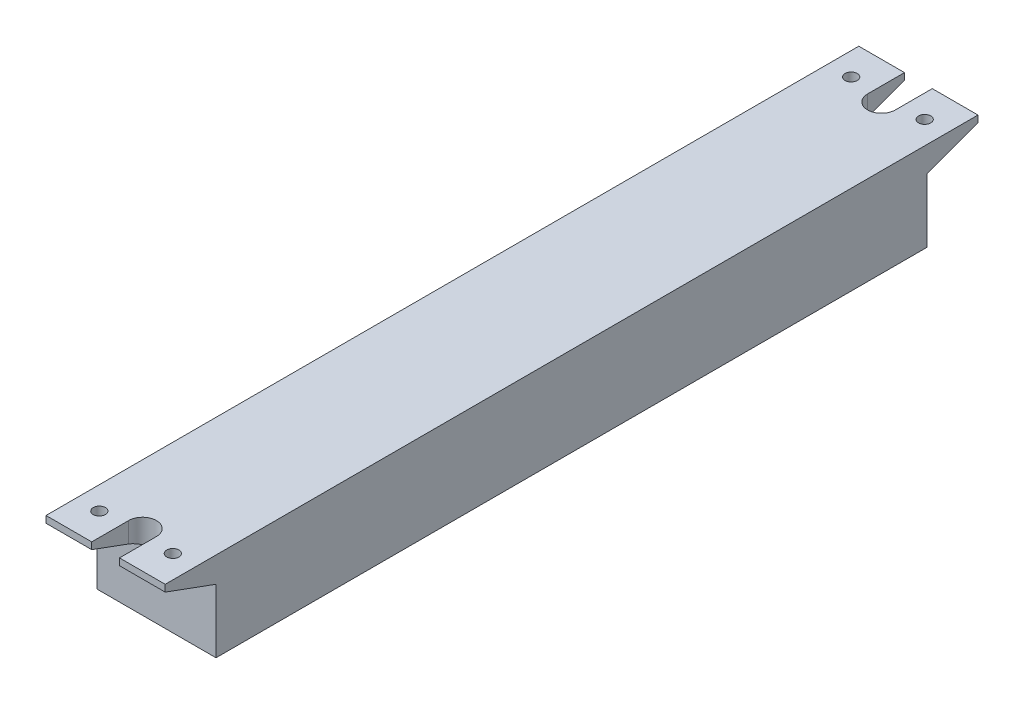
ISO-10303-21;
HEADER;
FILE_DESCRIPTION(('STEP AP214'),'2;1');
FILE_NAME('part.step','',(''),(''),'','','');
FILE_SCHEMA(('AUTOMOTIVE_DESIGN { 1 0 10303 214 1 1 1 1 }'));
ENDSEC;
DATA;
#1=APPLICATION_CONTEXT('core data for automotive mechanical design processes');
#2=APPLICATION_PROTOCOL_DEFINITION('international standard','automotive_design',2000,#1);
#3=PRODUCT_CONTEXT('',#1,'mechanical');
#4=PRODUCT('Part','Part','',(#3));
#5=PRODUCT_RELATED_PRODUCT_CATEGORY('part','',(#4));
#6=PRODUCT_DEFINITION_FORMATION('','',#4);
#7=PRODUCT_DEFINITION_CONTEXT('part definition',#1,'design');
#8=PRODUCT_DEFINITION('design','',#6,#7);
#9=PRODUCT_DEFINITION_SHAPE('','',#8);
#10=(LENGTH_UNIT() NAMED_UNIT(*) SI_UNIT(.MILLI.,.METRE.));
#11=(NAMED_UNIT(*) PLANE_ANGLE_UNIT() SI_UNIT($,.RADIAN.));
#12=(NAMED_UNIT(*) SI_UNIT($,.STERADIAN.) SOLID_ANGLE_UNIT());
#13=UNCERTAINTY_MEASURE_WITH_UNIT(LENGTH_MEASURE(1.E-05),#10,'distance_accuracy_value','');
#14=(GEOMETRIC_REPRESENTATION_CONTEXT(3) GLOBAL_UNCERTAINTY_ASSIGNED_CONTEXT((#13)) GLOBAL_UNIT_ASSIGNED_CONTEXT((#10,
#11,#12)) REPRESENTATION_CONTEXT('',''));
#15=CARTESIAN_POINT('',(0.,0.,0.));
#16=DIRECTION('',(0.,0.,1.));
#17=DIRECTION('',(1.,0.,0.));
#18=AXIS2_PLACEMENT_3D('',#15,#16,#17);
#19=CARTESIAN_POINT('',(35.2,13.15,120.));
#20=DIRECTION('',(0.,0.,-1.));
#21=DIRECTION('',(-1.,0.,0.));
#22=AXIS2_PLACEMENT_3D('',#19,#20,#21);
#23=PLANE('',#22);
#24=DIRECTION('',(-1.,0.,0.));
#25=VECTOR('',#24,1.);
#26=CARTESIAN_POINT('',(35.2,11.15,120.));
#27=LINE('',#26,#25);
#28=CARTESIAN_POINT('',(13.5,11.15,120.));
#29=VERTEX_POINT('',#28);
#30=CARTESIAN_POINT('',(0.,11.15,120.));
#31=VERTEX_POINT('',#30);
#32=EDGE_CURVE('E304',#29,#31,#27,.T.);
#33=ORIENTED_EDGE('',*,*,#32,.F.);
#34=DIRECTION('',(0.,-1.,0.));
#35=VECTOR('',#34,1.);
#36=CARTESIAN_POINT('',(13.5,22.05,120.));
#37=LINE('',#36,#35);
#38=CARTESIAN_POINT('',(13.5,13.1500000000004,120.));
#39=VERTEX_POINT('',#38);
#40=EDGE_CURVE('E219',#39,#29,#37,.T.);
#41=ORIENTED_EDGE('',*,*,#40,.F.);
#42=DIRECTION('',(-1.,0.,0.));
#43=VECTOR('',#42,1.);
#44=CARTESIAN_POINT('',(35.2,13.15,120.));
#45=LINE('',#44,#43);
#46=CARTESIAN_POINT('',(0.,13.15,120.));
#47=VERTEX_POINT('',#46);
#48=EDGE_CURVE('E307',#39,#47,#45,.T.);
#49=ORIENTED_EDGE('',*,*,#48,.T.);
#50=DIRECTION('',(0.,-1.,0.));
#51=VECTOR('',#50,1.);
#52=CARTESIAN_POINT('',(0.,13.15,120.));
#53=LINE('',#52,#51);
#54=EDGE_CURVE('E263',#47,#31,#53,.T.);
#55=ORIENTED_EDGE('',*,*,#54,.T.);
#56=EDGE_LOOP('',(#33,#41,#49,#55));
#57=FACE_BOUND('',#56,.T.);
#58=ADVANCED_FACE('F32',(#57),#23,.F.);
#59=CARTESIAN_POINT('',(35.2,11.15,120.));
#60=DIRECTION('',(0.,0.938876315886609,-0.344254649158423));
#61=DIRECTION('',(0.,0.344254649158423,0.938876315886609));
#62=AXIS2_PLACEMENT_3D('',#59,#60,#61);
#63=PLANE('',#62);
#64=CARTESIAN_POINT('',(6.75,7.84999999999999,111.));
#65=DIRECTION('',(0.,0.938876315886609,-0.344254649158423));
#66=DIRECTION('',(0.,-0.344254649158423,-0.938876315886609));
#67=AXIS2_PLACEMENT_3D('',#64,#65,#66);
#68=ELLIPSE('',#67,1.91718543704045,1.8);
#69=CARTESIAN_POINT('',(6.75,7.18999999999999,109.2));
#70=VERTEX_POINT('',#69);
#71=EDGE_CURVE('E194',#70,#70,#68,.T.);
#72=ORIENTED_EDGE('',*,*,#71,.T.);
#73=EDGE_LOOP('',(#72));
#74=FACE_BOUND('',#73,.T.);
#75=CARTESIAN_POINT('',(17.6,7.15333333333332,109.1));
#76=DIRECTION('',(0.,0.938876315886609,-0.344254649158423));
#77=DIRECTION('',(0.,-0.344254649158423,-0.938876315886609));
#78=AXIS2_PLACEMENT_3D('',#75,#76,#77);
#79=ELLIPSE('',#78,4.36692238436993,4.10000000000001);
#80=CARTESIAN_POINT('',(17.6,5.64999999999999,105.));
#81=VERTEX_POINT('',#80);
#82=CARTESIAN_POINT('',(13.5,7.15333333333332,109.1));
#83=VERTEX_POINT('',#82);
#84=EDGE_CURVE('E226',#81,#83,#79,.T.);
#85=ORIENTED_EDGE('',*,*,#84,.T.);
#86=DIRECTION('',(0.,0.344254649158423,0.938876315886609));
#87=VECTOR('',#86,1.);
#88=CARTESIAN_POINT('',(13.5,11.15,120.));
#89=LINE('',#88,#87);
#90=EDGE_CURVE('E223',#83,#29,#89,.T.);
#91=ORIENTED_EDGE('',*,*,#90,.T.);
#92=ORIENTED_EDGE('',*,*,#32,.T.);
#93=DIRECTION('',(0.,-0.344254649158423,-0.938876315886609));
#94=VECTOR('',#93,1.);
#95=CARTESIAN_POINT('',(0.,11.15,120.));
#96=LINE('',#95,#94);
#97=CARTESIAN_POINT('',(0.,5.64999999999999,105.));
#98=VERTEX_POINT('',#97);
#99=EDGE_CURVE('E266',#31,#98,#96,.T.);
#100=ORIENTED_EDGE('',*,*,#99,.T.);
#101=DIRECTION('',(-1.,0.,0.));
#102=VECTOR('',#101,1.);
#103=CARTESIAN_POINT('',(35.2,5.64999999999999,105.));
#104=LINE('',#103,#102);
#105=EDGE_CURVE('E300',#81,#98,#104,.T.);
#106=ORIENTED_EDGE('',*,*,#105,.F.);
#107=EDGE_LOOP('',(#85,#91,#92,#100,#106));
#108=FACE_BOUND('',#107,.T.);
#109=ADVANCED_FACE('F323',(#74,#108),#63,.F.);
#110=CARTESIAN_POINT('',(35.2,11.15,-120.));
#111=DIRECTION('',(0.,0.938876315886609,0.344254649158423));
#112=DIRECTION('',(0.,-0.344254649158423,0.938876315886609));
#113=AXIS2_PLACEMENT_3D('',#110,#111,#112);
#114=PLANE('',#113);
#115=CARTESIAN_POINT('',(28.45,7.84999999999999,-111.));
#116=DIRECTION('',(0.,0.938876315886609,0.344254649158423));
#117=DIRECTION('',(0.,-0.344254649158423,0.938876315886609));
#118=AXIS2_PLACEMENT_3D('',#115,#116,#117);
#119=ELLIPSE('',#118,1.91718543704045,1.8);
#120=CARTESIAN_POINT('',(28.45,7.18999999999999,-109.2));
#121=VERTEX_POINT('',#120);
#122=EDGE_CURVE('E186',#121,#121,#119,.T.);
#123=ORIENTED_EDGE('',*,*,#122,.T.);
#124=EDGE_LOOP('',(#123));
#125=FACE_BOUND('',#124,.T.);
#126=CARTESIAN_POINT('',(17.6,7.15333333333332,-109.1));
#127=DIRECTION('',(0.,0.938876315886609,0.344254649158423));
#128=DIRECTION('',(0.,-0.344254649158423,0.938876315886609));
#129=AXIS2_PLACEMENT_3D('',#126,#127,#128);
#130=ELLIPSE('',#129,4.36692238436993,4.10000000000001);
#131=CARTESIAN_POINT('',(17.6,5.64999999999998,-105.));
#132=VERTEX_POINT('',#131);
#133=CARTESIAN_POINT('',(21.7,7.15333333333332,-109.1));
#134=VERTEX_POINT('',#133);
#135=EDGE_CURVE('E241',#132,#134,#130,.T.);
#136=ORIENTED_EDGE('',*,*,#135,.T.);
#137=DIRECTION('',(0.,0.344254649158423,-0.938876315886609));
#138=VECTOR('',#137,1.);
#139=CARTESIAN_POINT('',(21.7,11.15,-120.));
#140=LINE('',#139,#138);
#141=CARTESIAN_POINT('',(21.7,11.15,-120.));
#142=VERTEX_POINT('',#141);
#143=EDGE_CURVE('E209',#134,#142,#140,.T.);
#144=ORIENTED_EDGE('',*,*,#143,.T.);
#145=DIRECTION('',(-1.,0.,0.));
#146=VECTOR('',#145,1.);
#147=CARTESIAN_POINT('',(35.2,11.15,-120.));
#148=LINE('',#147,#146);
#149=CARTESIAN_POINT('',(35.2,11.15,-120.));
#150=VERTEX_POINT('',#149);
#151=EDGE_CURVE('E289',#150,#142,#148,.T.);
#152=ORIENTED_EDGE('',*,*,#151,.F.);
#153=DIRECTION('',(0.,0.344254649158423,-0.938876315886609));
#154=VECTOR('',#153,1.);
#155=CARTESIAN_POINT('',(35.2,11.15,-120.));
#156=LINE('',#155,#154);
#157=CARTESIAN_POINT('',(35.2,5.64999999999999,-105.));
#158=VERTEX_POINT('',#157);
#159=EDGE_CURVE('E257',#158,#150,#156,.T.);
#160=ORIENTED_EDGE('',*,*,#159,.F.);
#161=DIRECTION('',(-1.,0.,0.));
#162=VECTOR('',#161,1.);
#163=CARTESIAN_POINT('',(35.2,5.64999999999999,-105.));
#164=LINE('',#163,#162);
#165=EDGE_CURVE('E293',#158,#132,#164,.T.);
#166=ORIENTED_EDGE('',*,*,#165,.T.);
#167=EDGE_LOOP('',(#136,#144,#152,#160,#166));
#168=FACE_BOUND('',#167,.T.);
#169=ADVANCED_FACE('F341',(#125,#168),#114,.F.);
#170=CARTESIAN_POINT('',(35.2,13.15,-120.));
#171=DIRECTION('',(0.,0.,1.));
#172=DIRECTION('',(1.,0.,0.));
#173=AXIS2_PLACEMENT_3D('',#170,#171,#172);
#174=PLANE('',#173);
#175=ORIENTED_EDGE('',*,*,#151,.T.);
#176=DIRECTION('',(0.,-1.,0.));
#177=VECTOR('',#176,1.);
#178=CARTESIAN_POINT('',(21.7,22.05,-120.));
#179=LINE('',#178,#177);
#180=CARTESIAN_POINT('',(21.7,13.15,-120.));
#181=VERTEX_POINT('',#180);
#182=EDGE_CURVE('E210',#181,#142,#179,.T.);
#183=ORIENTED_EDGE('',*,*,#182,.F.);
#184=DIRECTION('',(-1.,0.,0.));
#185=VECTOR('',#184,1.);
#186=CARTESIAN_POINT('',(35.2,13.15,-120.));
#187=LINE('',#186,#185);
#188=CARTESIAN_POINT('',(35.2,13.15,-120.));
#189=VERTEX_POINT('',#188);
#190=EDGE_CURVE('E286',#189,#181,#187,.T.);
#191=ORIENTED_EDGE('',*,*,#190,.F.);
#192=DIRECTION('',(0.,1.,0.));
#193=VECTOR('',#192,1.);
#194=CARTESIAN_POINT('',(35.2,13.15,-120.));
#195=LINE('',#194,#193);
#196=EDGE_CURVE('E259',#150,#189,#195,.T.);
#197=ORIENTED_EDGE('',*,*,#196,.F.);
#198=EDGE_LOOP('',(#175,#183,#191,#197));
#199=FACE_BOUND('',#198,.T.);
#200=ADVANCED_FACE('F338',(#199),#174,.F.);
#201=CARTESIAN_POINT('',(35.2,13.15,120.));
#202=VERTEX_POINT('',#201);
#203=CARTESIAN_POINT('',(21.7,13.15,120.));
#204=VERTEX_POINT('',#203);
#205=EDGE_CURVE('E159',#202,#204,#45,.T.);
#206=ORIENTED_EDGE('',*,*,#205,.T.);
#207=DIRECTION('',(0.,-1.,0.));
#208=VECTOR('',#207,1.);
#209=CARTESIAN_POINT('',(21.7,22.05,120.));
#210=LINE('',#209,#208);
#211=CARTESIAN_POINT('',(21.7,11.15,120.));
#212=VERTEX_POINT('',#211);
#213=EDGE_CURVE('E55',#204,#212,#210,.T.);
#214=ORIENTED_EDGE('',*,*,#213,.T.);
#215=CARTESIAN_POINT('',(35.2,11.15,120.));
#216=VERTEX_POINT('',#215);
#217=EDGE_CURVE('E305',#216,#212,#27,.T.);
#218=ORIENTED_EDGE('',*,*,#217,.F.);
#219=DIRECTION('',(0.,-1.,0.));
#220=VECTOR('',#219,1.);
#221=CARTESIAN_POINT('',(35.2,13.15,120.));
#222=LINE('',#221,#220);
#223=EDGE_CURVE('E246',#202,#216,#222,.T.);
#224=ORIENTED_EDGE('',*,*,#223,.F.);
#225=EDGE_LOOP('',(#206,#214,#218,#224));
#226=FACE_BOUND('',#225,.T.);
#227=ADVANCED_FACE('F34',(#226),#23,.F.);
#228=CARTESIAN_POINT('',(28.45,7.84999999999999,111.));
#229=DIRECTION('',(0.,0.938876315886609,-0.344254649158423));
#230=DIRECTION('',(0.,-0.344254649158423,-0.938876315886609));
#231=AXIS2_PLACEMENT_3D('',#228,#229,#230);
#232=ELLIPSE('',#231,1.91718543704045,1.8);
#233=CARTESIAN_POINT('',(28.45,7.18999999999999,109.2));
#234=VERTEX_POINT('',#233);
#235=EDGE_CURVE('E190',#234,#234,#232,.T.);
#236=ORIENTED_EDGE('',*,*,#235,.T.);
#237=EDGE_LOOP('',(#236));
#238=FACE_BOUND('',#237,.T.);
#239=DIRECTION('',(0.,-0.344254649158423,-0.938876315886609));
#240=VECTOR('',#239,1.);
#241=CARTESIAN_POINT('',(21.7,11.15,120.));
#242=LINE('',#241,#240);
#243=CARTESIAN_POINT('',(21.7,7.15333333333332,109.1));
#244=VERTEX_POINT('',#243);
#245=EDGE_CURVE('E218',#212,#244,#242,.T.);
#246=ORIENTED_EDGE('',*,*,#245,.T.);
#247=EDGE_CURVE('E166',#244,#81,#79,.T.);
#248=ORIENTED_EDGE('',*,*,#247,.T.);
#249=CARTESIAN_POINT('',(35.2,5.64999999999999,105.));
#250=VERTEX_POINT('',#249);
#251=EDGE_CURVE('E301',#250,#81,#104,.T.);
#252=ORIENTED_EDGE('',*,*,#251,.F.);
#253=DIRECTION('',(0.,-0.344254649158423,-0.938876315886609));
#254=VECTOR('',#253,1.);
#255=CARTESIAN_POINT('',(35.2,11.15,120.));
#256=LINE('',#255,#254);
#257=EDGE_CURVE('E249',#216,#250,#256,.T.);
#258=ORIENTED_EDGE('',*,*,#257,.F.);
#259=ORIENTED_EDGE('',*,*,#217,.T.);
#260=EDGE_LOOP('',(#246,#248,#252,#258,#259));
#261=FACE_BOUND('',#260,.T.);
#262=ADVANCED_FACE('F328',(#238,#261),#63,.F.);
#263=CARTESIAN_POINT('',(35.2,-13.15,105.));
#264=DIRECTION('',(0.,0.,-1.));
#265=DIRECTION('',(-1.,0.,0.));
#266=AXIS2_PLACEMENT_3D('',#263,#264,#265);
#267=PLANE('',#266);
#268=ORIENTED_EDGE('',*,*,#251,.T.);
#269=ORIENTED_EDGE('',*,*,#105,.T.);
#270=DIRECTION('',(0.,-1.,0.));
#271=VECTOR('',#270,1.);
#272=CARTESIAN_POINT('',(0.,-13.15,105.));
#273=LINE('',#272,#271);
#274=CARTESIAN_POINT('',(0.,-13.15,105.));
#275=VERTEX_POINT('',#274);
#276=EDGE_CURVE('E269',#98,#275,#273,.T.);
#277=ORIENTED_EDGE('',*,*,#276,.T.);
#278=DIRECTION('',(-1.,0.,0.));
#279=VECTOR('',#278,1.);
#280=CARTESIAN_POINT('',(35.2,-13.15,105.));
#281=LINE('',#280,#279);
#282=CARTESIAN_POINT('',(35.2,-13.15,105.));
#283=VERTEX_POINT('',#282);
#284=EDGE_CURVE('E298',#283,#275,#281,.T.);
#285=ORIENTED_EDGE('',*,*,#284,.F.);
#286=DIRECTION('',(0.,-1.,0.));
#287=VECTOR('',#286,1.);
#288=CARTESIAN_POINT('',(35.2,-13.15,105.));
#289=LINE('',#288,#287);
#290=EDGE_CURVE('E251',#250,#283,#289,.T.);
#291=ORIENTED_EDGE('',*,*,#290,.F.);
#292=EDGE_LOOP('',(#268,#269,#277,#285,#291));
#293=FACE_BOUND('',#292,.T.);
#294=ADVANCED_FACE('F377',(#293),#267,.F.);
#295=CARTESIAN_POINT('',(35.2,-13.15,-105.));
#296=DIRECTION('',(0.,1.,0.));
#297=DIRECTION('',(0.,0.,1.));
#298=AXIS2_PLACEMENT_3D('',#295,#296,#297);
#299=PLANE('',#298);
#300=DIRECTION('',(0.,0.,-1.));
#301=VECTOR('',#300,1.);
#302=CARTESIAN_POINT('',(0.,-13.15,-105.));
#303=LINE('',#302,#301);
#304=CARTESIAN_POINT('',(0.,-13.15,-105.));
#305=VERTEX_POINT('',#304);
#306=EDGE_CURVE('E272',#275,#305,#303,.T.);
#307=ORIENTED_EDGE('',*,*,#306,.T.);
#308=DIRECTION('',(-1.,0.,0.));
#309=VECTOR('',#308,1.);
#310=CARTESIAN_POINT('',(35.2,-13.15,-105.));
#311=LINE('',#310,#309);
#312=CARTESIAN_POINT('',(35.2,-13.15,-105.));
#313=VERTEX_POINT('',#312);
#314=EDGE_CURVE('E296',#313,#305,#311,.T.);
#315=ORIENTED_EDGE('',*,*,#314,.F.);
#316=DIRECTION('',(0.,0.,-1.));
#317=VECTOR('',#316,1.);
#318=CARTESIAN_POINT('',(35.2,-13.15,-105.));
#319=LINE('',#318,#317);
#320=EDGE_CURVE('E253',#283,#313,#319,.T.);
#321=ORIENTED_EDGE('',*,*,#320,.F.);
#322=ORIENTED_EDGE('',*,*,#284,.T.);
#323=EDGE_LOOP('',(#307,#315,#321,#322));
#324=FACE_BOUND('',#323,.T.);
#325=ADVANCED_FACE('F382',(#324),#299,.F.);
#326=CARTESIAN_POINT('',(35.2,-13.15,-105.));
#327=DIRECTION('',(0.,0.,1.));
#328=DIRECTION('',(0.,-1.,0.));
#329=AXIS2_PLACEMENT_3D('',#326,#327,#328);
#330=PLANE('',#329);
#331=CARTESIAN_POINT('',(0.,5.64999999999999,-105.));
#332=VERTEX_POINT('',#331);
#333=EDGE_CURVE('E292',#132,#332,#164,.T.);
#334=ORIENTED_EDGE('',*,*,#333,.F.);
#335=ORIENTED_EDGE('',*,*,#165,.F.);
#336=DIRECTION('',(0.,1.,0.));
#337=VECTOR('',#336,1.);
#338=CARTESIAN_POINT('',(35.2,-13.15,-105.));
#339=LINE('',#338,#337);
#340=EDGE_CURVE('E255',#313,#158,#339,.T.);
#341=ORIENTED_EDGE('',*,*,#340,.F.);
#342=ORIENTED_EDGE('',*,*,#314,.T.);
#343=DIRECTION('',(0.,1.,0.));
#344=VECTOR('',#343,1.);
#345=CARTESIAN_POINT('',(0.,-13.15,-105.));
#346=LINE('',#345,#344);
#347=EDGE_CURVE('E275',#305,#332,#346,.T.);
#348=ORIENTED_EDGE('',*,*,#347,.T.);
#349=EDGE_LOOP('',(#334,#335,#341,#342,#348));
#350=FACE_BOUND('',#349,.T.);
#351=ADVANCED_FACE('F350',(#350),#330,.F.);
#352=CARTESIAN_POINT('',(6.75,7.84999999999999,-111.));
#353=DIRECTION('',(0.,0.938876315886609,0.344254649158423));
#354=DIRECTION('',(0.,-0.344254649158423,0.938876315886609));
#355=AXIS2_PLACEMENT_3D('',#352,#353,#354);
#356=ELLIPSE('',#355,1.91718543704045,1.8);
#357=CARTESIAN_POINT('',(6.75,7.18999999999999,-109.2));
#358=VERTEX_POINT('',#357);
#359=EDGE_CURVE('E182',#358,#358,#356,.T.);
#360=ORIENTED_EDGE('',*,*,#359,.T.);
#361=EDGE_LOOP('',(#360));
#362=FACE_BOUND('',#361,.T.);
#363=DIRECTION('',(0.,-0.344254649158423,0.938876315886609));
#364=VECTOR('',#363,1.);
#365=CARTESIAN_POINT('',(13.5,11.15,-120.));
#366=LINE('',#365,#364);
#367=CARTESIAN_POINT('',(13.5,11.15,-120.));
#368=VERTEX_POINT('',#367);
#369=CARTESIAN_POINT('',(13.5,7.15333333333332,-109.1));
#370=VERTEX_POINT('',#369);
#371=EDGE_CURVE('E237',#368,#370,#366,.T.);
#372=ORIENTED_EDGE('',*,*,#371,.T.);
#373=EDGE_CURVE('E243',#370,#132,#130,.T.);
#374=ORIENTED_EDGE('',*,*,#373,.T.);
#375=ORIENTED_EDGE('',*,*,#333,.T.);
#376=DIRECTION('',(0.,0.344254649158423,-0.938876315886609));
#377=VECTOR('',#376,1.);
#378=CARTESIAN_POINT('',(0.,11.15,-120.));
#379=LINE('',#378,#377);
#380=CARTESIAN_POINT('',(0.,11.15,-120.));
#381=VERTEX_POINT('',#380);
#382=EDGE_CURVE('E278',#332,#381,#379,.T.);
#383=ORIENTED_EDGE('',*,*,#382,.T.);
#384=EDGE_CURVE('E288',#368,#381,#148,.T.);
#385=ORIENTED_EDGE('',*,*,#384,.F.);
#386=EDGE_LOOP('',(#372,#374,#375,#383,#385));
#387=FACE_BOUND('',#386,.T.);
#388=ADVANCED_FACE('F347',(#362,#387),#114,.F.);
#389=CARTESIAN_POINT('',(13.5,13.15,-120.));
#390=VERTEX_POINT('',#389);
#391=CARTESIAN_POINT('',(0.,13.15,-120.));
#392=VERTEX_POINT('',#391);
#393=EDGE_CURVE('E262',#390,#392,#187,.T.);
#394=ORIENTED_EDGE('',*,*,#393,.F.);
#395=DIRECTION('',(0.,-1.,0.));
#396=VECTOR('',#395,1.);
#397=CARTESIAN_POINT('',(13.5,22.05,-120.));
#398=LINE('',#397,#396);
#399=EDGE_CURVE('E47',#390,#368,#398,.T.);
#400=ORIENTED_EDGE('',*,*,#399,.T.);
#401=ORIENTED_EDGE('',*,*,#384,.T.);
#402=DIRECTION('',(0.,1.,0.));
#403=VECTOR('',#402,1.);
#404=CARTESIAN_POINT('',(0.,13.15,-120.));
#405=LINE('',#404,#403);
#406=EDGE_CURVE('E281',#381,#392,#405,.T.);
#407=ORIENTED_EDGE('',*,*,#406,.T.);
#408=EDGE_LOOP('',(#394,#400,#401,#407));
#409=FACE_BOUND('',#408,.T.);
#410=ADVANCED_FACE('F356',(#409),#174,.F.);
#411=CARTESIAN_POINT('',(35.2,13.15,-105.));
#412=DIRECTION('',(0.,-1.,0.));
#413=DIRECTION('',(0.,0.,-1.));
#414=AXIS2_PLACEMENT_3D('',#411,#412,#413);
#415=PLANE('',#414);
#416=CARTESIAN_POINT('',(6.75,13.1500000000004,111.));
#417=DIRECTION('',(0.,-1.,0.));
#418=DIRECTION('',(0.,0.,-1.));
#419=AXIS2_PLACEMENT_3D('',#416,#417,#418);
#420=CIRCLE('',#419,1.8);
#421=CARTESIAN_POINT('',(6.75,13.1500000000004,109.2));
#422=VERTEX_POINT('',#421);
#423=EDGE_CURVE('E191',#422,#422,#420,.T.);
#424=ORIENTED_EDGE('',*,*,#423,.T.);
#425=EDGE_LOOP('',(#424));
#426=FACE_BOUND('',#425,.T.);
#427=CARTESIAN_POINT('',(28.45,13.1500000000004,111.));
#428=DIRECTION('',(0.,-1.,0.));
#429=DIRECTION('',(0.,0.,-1.));
#430=AXIS2_PLACEMENT_3D('',#427,#428,#429);
#431=CIRCLE('',#430,1.8);
#432=CARTESIAN_POINT('',(28.45,13.1500000000004,109.2));
#433=VERTEX_POINT('',#432);
#434=EDGE_CURVE('E187',#433,#433,#431,.T.);
#435=ORIENTED_EDGE('',*,*,#434,.T.);
#436=EDGE_LOOP('',(#435));
#437=FACE_BOUND('',#436,.T.);
#438=CARTESIAN_POINT('',(28.45,13.15,-111.));
#439=DIRECTION('',(0.,-1.,0.));
#440=DIRECTION('',(0.,0.,-1.));
#441=AXIS2_PLACEMENT_3D('',#438,#439,#440);
#442=CIRCLE('',#441,1.8);
#443=CARTESIAN_POINT('',(28.45,13.15,-112.8));
#444=VERTEX_POINT('',#443);
#445=EDGE_CURVE('E183',#444,#444,#442,.T.);
#446=ORIENTED_EDGE('',*,*,#445,.T.);
#447=EDGE_LOOP('',(#446));
#448=FACE_BOUND('',#447,.T.);
#449=CARTESIAN_POINT('',(6.75,13.15,-111.));
#450=DIRECTION('',(0.,-1.,0.));
#451=DIRECTION('',(0.,0.,-1.));
#452=AXIS2_PLACEMENT_3D('',#449,#450,#451);
#453=CIRCLE('',#452,1.8);
#454=CARTESIAN_POINT('',(6.75,13.15,-112.8));
#455=VERTEX_POINT('',#454);
#456=EDGE_CURVE('E179',#455,#455,#453,.T.);
#457=ORIENTED_EDGE('',*,*,#456,.T.);
#458=EDGE_LOOP('',(#457));
#459=FACE_BOUND('',#458,.T.);
#460=ORIENTED_EDGE('',*,*,#190,.T.);
#461=DIRECTION('',(0.,0.,1.));
#462=VECTOR('',#461,1.);
#463=CARTESIAN_POINT('',(21.7,13.15,-105.));
#464=LINE('',#463,#462);
#465=CARTESIAN_POINT('',(21.7,13.15,-109.1));
#466=VERTEX_POINT('',#465);
#467=EDGE_CURVE('E11',#181,#466,#464,.T.);
#468=ORIENTED_EDGE('',*,*,#467,.T.);
#469=CARTESIAN_POINT('',(17.6,13.15,-109.1));
#470=DIRECTION('',(0.,-1.,0.));
#471=DIRECTION('',(0.,0.,-1.));
#472=AXIS2_PLACEMENT_3D('',#469,#470,#471);
#473=CIRCLE('',#472,4.10000000000001);
#474=CARTESIAN_POINT('',(13.5,13.15,-109.1));
#475=VERTEX_POINT('',#474);
#476=EDGE_CURVE('E40',#466,#475,#473,.T.);
#477=ORIENTED_EDGE('',*,*,#476,.T.);
#478=DIRECTION('',(0.,0.,-1.));
#479=VECTOR('',#478,1.);
#480=CARTESIAN_POINT('',(13.5,13.15,-105.));
#481=LINE('',#480,#479);
#482=EDGE_CURVE('E175',#475,#390,#481,.T.);
#483=ORIENTED_EDGE('',*,*,#482,.T.);
#484=ORIENTED_EDGE('',*,*,#393,.T.);
#485=DIRECTION('',(0.,0.,1.));
#486=VECTOR('',#485,1.);
#487=CARTESIAN_POINT('',(0.,13.15,-105.));
#488=LINE('',#487,#486);
#489=EDGE_CURVE('E247',#392,#47,#488,.T.);
#490=ORIENTED_EDGE('',*,*,#489,.T.);
#491=ORIENTED_EDGE('',*,*,#48,.F.);
#492=DIRECTION('',(0.,0.,-1.));
#493=VECTOR('',#492,1.);
#494=CARTESIAN_POINT('',(13.5,13.15,-105.));
#495=LINE('',#494,#493);
#496=CARTESIAN_POINT('',(13.5,13.1500000000004,109.1));
#497=VERTEX_POINT('',#496);
#498=EDGE_CURVE('E173',#39,#497,#495,.T.);
#499=ORIENTED_EDGE('',*,*,#498,.T.);
#500=CARTESIAN_POINT('',(17.6,13.1500000000004,109.1));
#501=DIRECTION('',(0.,-1.,0.));
#502=DIRECTION('',(0.,0.,-1.));
#503=AXIS2_PLACEMENT_3D('',#500,#501,#502);
#504=CIRCLE('',#503,4.10000000000001);
#505=CARTESIAN_POINT('',(21.7,13.1500000000004,109.1));
#506=VERTEX_POINT('',#505);
#507=EDGE_CURVE('E158',#497,#506,#504,.T.);
#508=ORIENTED_EDGE('',*,*,#507,.T.);
#509=DIRECTION('',(0.,0.,1.));
#510=VECTOR('',#509,1.);
#511=CARTESIAN_POINT('',(21.7,13.15,-105.));
#512=LINE('',#511,#510);
#513=EDGE_CURVE('E149',#506,#204,#512,.T.);
#514=ORIENTED_EDGE('',*,*,#513,.T.);
#515=ORIENTED_EDGE('',*,*,#205,.F.);
#516=DIRECTION('',(0.,0.,1.));
#517=VECTOR('',#516,1.);
#518=CARTESIAN_POINT('',(35.2,13.15,-105.));
#519=LINE('',#518,#517);
#520=EDGE_CURVE('E244',#189,#202,#519,.T.);
#521=ORIENTED_EDGE('',*,*,#520,.F.);
#522=EDGE_LOOP('',(#460,#468,#477,#483,#484,#490,#491,#499,#508,#514,#515,#521));
#523=FACE_BOUND('',#522,.T.);
#524=ADVANCED_FACE('F171',(#426,#437,#448,#459,#523),#415,.F.);
#525=CARTESIAN_POINT('',(35.2,0.,0.));
#526=DIRECTION('',(1.,0.,0.));
#527=DIRECTION('',(0.,0.,-1.));
#528=AXIS2_PLACEMENT_3D('',#525,#526,#527);
#529=PLANE('',#528);
#530=ORIENTED_EDGE('',*,*,#520,.T.);
#531=ORIENTED_EDGE('',*,*,#223,.T.);
#532=ORIENTED_EDGE('',*,*,#257,.T.);
#533=ORIENTED_EDGE('',*,*,#290,.T.);
#534=ORIENTED_EDGE('',*,*,#320,.T.);
#535=ORIENTED_EDGE('',*,*,#340,.T.);
#536=ORIENTED_EDGE('',*,*,#159,.T.);
#537=ORIENTED_EDGE('',*,*,#196,.T.);
#538=EDGE_LOOP('',(#530,#531,#532,#533,#534,#535,#536,#537));
#539=FACE_BOUND('',#538,.T.);
#540=ADVANCED_FACE('F333',(#539),#529,.T.);
#541=CARTESIAN_POINT('',(0.,0.,0.));
#542=DIRECTION('',(1.,0.,0.));
#543=DIRECTION('',(0.,0.,-1.));
#544=AXIS2_PLACEMENT_3D('',#541,#542,#543);
#545=PLANE('',#544);
#546=ORIENTED_EDGE('',*,*,#54,.F.);
#547=ORIENTED_EDGE('',*,*,#489,.F.);
#548=ORIENTED_EDGE('',*,*,#406,.F.);
#549=ORIENTED_EDGE('',*,*,#382,.F.);
#550=ORIENTED_EDGE('',*,*,#347,.F.);
#551=ORIENTED_EDGE('',*,*,#306,.F.);
#552=ORIENTED_EDGE('',*,*,#276,.F.);
#553=ORIENTED_EDGE('',*,*,#99,.F.);
#554=EDGE_LOOP('',(#546,#547,#548,#549,#550,#551,#552,#553));
#555=FACE_BOUND('',#554,.T.);
#556=ADVANCED_FACE('F318',(#555),#545,.F.);
#557=CARTESIAN_POINT('',(17.6,22.05,109.1));
#558=DIRECTION('',(0.,-1.,0.));
#559=DIRECTION('',(0.,0.,-1.));
#560=AXIS2_PLACEMENT_3D('',#557,#558,#559);
#561=CYLINDRICAL_SURFACE('',#560,4.10000000000001);
#562=DIRECTION('',(0.,-1.,0.));
#563=VECTOR('',#562,1.);
#564=CARTESIAN_POINT('',(21.7,22.05,109.1));
#565=LINE('',#564,#563);
#566=EDGE_CURVE('E152',#506,#244,#565,.T.);
#567=ORIENTED_EDGE('',*,*,#566,.F.);
#568=ORIENTED_EDGE('',*,*,#507,.F.);
#569=DIRECTION('',(0.,-1.,0.));
#570=VECTOR('',#569,1.);
#571=CARTESIAN_POINT('',(13.5,22.05,109.1));
#572=LINE('',#571,#570);
#573=EDGE_CURVE('E216',#497,#83,#572,.T.);
#574=ORIENTED_EDGE('',*,*,#573,.T.);
#575=ORIENTED_EDGE('',*,*,#84,.F.);
#576=ORIENTED_EDGE('',*,*,#247,.F.);
#577=EDGE_LOOP('',(#567,#568,#574,#575,#576));
#578=FACE_BOUND('',#577,.T.);
#579=ADVANCED_FACE('F162',(#578),#561,.F.);
#580=CARTESIAN_POINT('',(13.5,22.05,109.1));
#581=DIRECTION('',(-1.,0.,0.));
#582=DIRECTION('',(0.,0.,1.));
#583=AXIS2_PLACEMENT_3D('',#580,#581,#582);
#584=PLANE('',#583);
#585=ORIENTED_EDGE('',*,*,#573,.F.);
#586=ORIENTED_EDGE('',*,*,#498,.F.);
#587=ORIENTED_EDGE('',*,*,#40,.T.);
#588=ORIENTED_EDGE('',*,*,#90,.F.);
#589=EDGE_LOOP('',(#585,#586,#587,#588));
#590=FACE_BOUND('',#589,.T.);
#591=ADVANCED_FACE('F325',(#590),#584,.F.);
#592=CARTESIAN_POINT('',(21.7,22.05,109.1));
#593=DIRECTION('',(1.,0.,0.));
#594=DIRECTION('',(0.,0.,-1.));
#595=AXIS2_PLACEMENT_3D('',#592,#593,#594);
#596=PLANE('',#595);
#597=ORIENTED_EDGE('',*,*,#213,.F.);
#598=ORIENTED_EDGE('',*,*,#513,.F.);
#599=ORIENTED_EDGE('',*,*,#566,.T.);
#600=ORIENTED_EDGE('',*,*,#245,.F.);
#601=EDGE_LOOP('',(#597,#598,#599,#600));
#602=FACE_BOUND('',#601,.T.);
#603=ADVANCED_FACE('F151',(#602),#596,.F.);
#604=CARTESIAN_POINT('',(6.75,22.05,-111.));
#605=DIRECTION('',(0.,-1.,0.));
#606=DIRECTION('',(0.,0.,-1.));
#607=AXIS2_PLACEMENT_3D('',#604,#605,#606);
#608=CYLINDRICAL_SURFACE('',#607,1.8);
#609=ORIENTED_EDGE('',*,*,#456,.F.);
#610=EDGE_LOOP('',(#609));
#611=FACE_BOUND('',#610,.T.);
#612=ORIENTED_EDGE('',*,*,#359,.F.);
#613=EDGE_LOOP('',(#612));
#614=FACE_BOUND('',#613,.T.);
#615=ADVANCED_FACE('F439',(#611,#614),#608,.F.);
#616=CARTESIAN_POINT('',(28.45,22.05,-111.));
#617=DIRECTION('',(0.,-1.,0.));
#618=DIRECTION('',(0.,0.,-1.));
#619=AXIS2_PLACEMENT_3D('',#616,#617,#618);
#620=CYLINDRICAL_SURFACE('',#619,1.8);
#621=ORIENTED_EDGE('',*,*,#445,.F.);
#622=EDGE_LOOP('',(#621));
#623=FACE_BOUND('',#622,.T.);
#624=ORIENTED_EDGE('',*,*,#122,.F.);
#625=EDGE_LOOP('',(#624));
#626=FACE_BOUND('',#625,.T.);
#627=ADVANCED_FACE('F448',(#623,#626),#620,.F.);
#628=CARTESIAN_POINT('',(28.45,22.05,111.));
#629=DIRECTION('',(0.,-1.,0.));
#630=DIRECTION('',(0.,0.,-1.));
#631=AXIS2_PLACEMENT_3D('',#628,#629,#630);
#632=CYLINDRICAL_SURFACE('',#631,1.8);
#633=ORIENTED_EDGE('',*,*,#434,.F.);
#634=EDGE_LOOP('',(#633));
#635=FACE_BOUND('',#634,.T.);
#636=ORIENTED_EDGE('',*,*,#235,.F.);
#637=EDGE_LOOP('',(#636));
#638=FACE_BOUND('',#637,.T.);
#639=ADVANCED_FACE('F458',(#635,#638),#632,.F.);
#640=CARTESIAN_POINT('',(6.75,22.05,111.));
#641=DIRECTION('',(0.,-1.,0.));
#642=DIRECTION('',(0.,0.,-1.));
#643=AXIS2_PLACEMENT_3D('',#640,#641,#642);
#644=CYLINDRICAL_SURFACE('',#643,1.8);
#645=ORIENTED_EDGE('',*,*,#423,.F.);
#646=EDGE_LOOP('',(#645));
#647=FACE_BOUND('',#646,.T.);
#648=ORIENTED_EDGE('',*,*,#71,.F.);
#649=EDGE_LOOP('',(#648));
#650=FACE_BOUND('',#649,.T.);
#651=ADVANCED_FACE('F468',(#647,#650),#644,.F.);
#652=CARTESIAN_POINT('',(17.6,22.05,-109.1));
#653=DIRECTION('',(0.,-1.,0.));
#654=DIRECTION('',(0.,0.,-1.));
#655=AXIS2_PLACEMENT_3D('',#652,#653,#654);
#656=CYLINDRICAL_SURFACE('',#655,4.10000000000001);
#657=DIRECTION('',(0.,-1.,0.));
#658=VECTOR('',#657,1.);
#659=CARTESIAN_POINT('',(13.5,22.05,-109.1));
#660=LINE('',#659,#658);
#661=EDGE_CURVE('E204',#475,#370,#660,.T.);
#662=ORIENTED_EDGE('',*,*,#661,.F.);
#663=ORIENTED_EDGE('',*,*,#476,.F.);
#664=DIRECTION('',(0.,-1.,0.));
#665=VECTOR('',#664,1.);
#666=CARTESIAN_POINT('',(21.7,22.05,-109.1));
#667=LINE('',#666,#665);
#668=EDGE_CURVE('E167',#466,#134,#667,.T.);
#669=ORIENTED_EDGE('',*,*,#668,.T.);
#670=ORIENTED_EDGE('',*,*,#135,.F.);
#671=ORIENTED_EDGE('',*,*,#373,.F.);
#672=EDGE_LOOP('',(#662,#663,#669,#670,#671));
#673=FACE_BOUND('',#672,.T.);
#674=ADVANCED_FACE('F201',(#673),#656,.F.);
#675=CARTESIAN_POINT('',(21.7,22.05,-109.1));
#676=DIRECTION('',(1.,0.,0.));
#677=DIRECTION('',(0.,0.,-1.));
#678=AXIS2_PLACEMENT_3D('',#675,#676,#677);
#679=PLANE('',#678);
#680=ORIENTED_EDGE('',*,*,#668,.F.);
#681=ORIENTED_EDGE('',*,*,#467,.F.);
#682=ORIENTED_EDGE('',*,*,#182,.T.);
#683=ORIENTED_EDGE('',*,*,#143,.F.);
#684=EDGE_LOOP('',(#680,#681,#682,#683));
#685=FACE_BOUND('',#684,.T.);
#686=ADVANCED_FACE('F206',(#685),#679,.F.);
#687=CARTESIAN_POINT('',(13.5,22.05,-109.1));
#688=DIRECTION('',(-1.,0.,0.));
#689=DIRECTION('',(0.,0.,1.));
#690=AXIS2_PLACEMENT_3D('',#687,#688,#689);
#691=PLANE('',#690);
#692=ORIENTED_EDGE('',*,*,#399,.F.);
#693=ORIENTED_EDGE('',*,*,#482,.F.);
#694=ORIENTED_EDGE('',*,*,#661,.T.);
#695=ORIENTED_EDGE('',*,*,#371,.F.);
#696=EDGE_LOOP('',(#692,#693,#694,#695));
#697=FACE_BOUND('',#696,.T.);
#698=ADVANCED_FACE('F495',(#697),#691,.F.);
#699=CLOSED_SHELL('',(#58,#109,#169,#200,#227,#262,#294,#325,#351,#388,#410,#524,#540,#556,#579,
#591,#603,#615,#627,#639,#651,#674,#686,#698));
#700=MANIFOLD_SOLID_BREP('B2',#699);
#701=ADVANCED_BREP_SHAPE_REPRESENTATION('',(#18,#700),#14);
#702=SHAPE_DEFINITION_REPRESENTATION(#9,#701);
ENDSEC;
END-ISO-10303-21;
